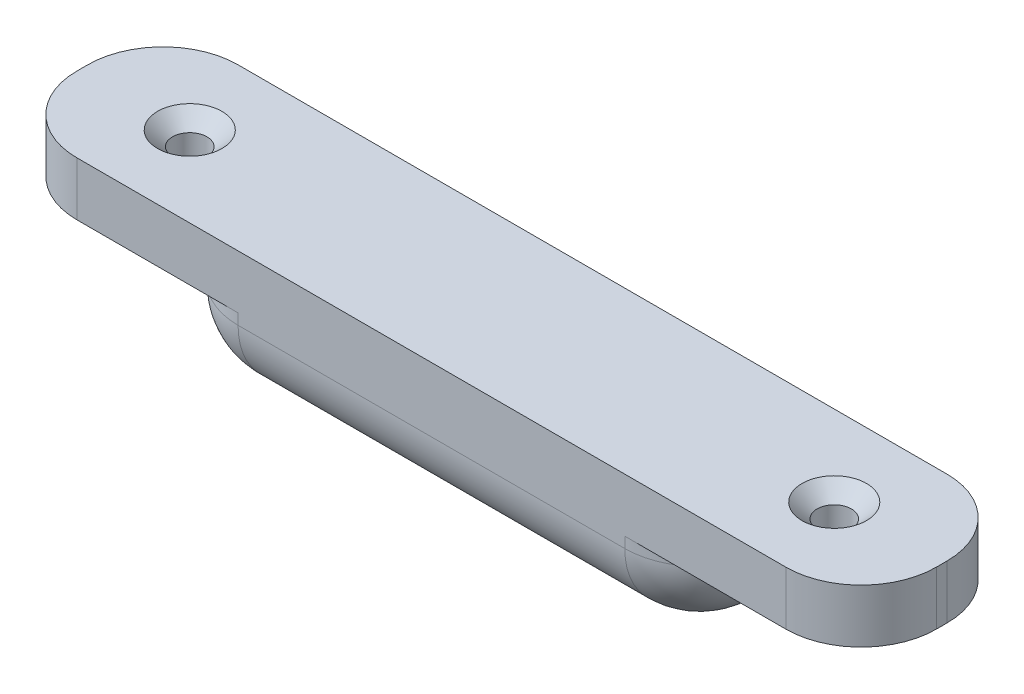
ISO-10303-21;
HEADER;
FILE_DESCRIPTION(('STEP AP214'),'2;1');
FILE_NAME('part.step','',(''),(''),'','','');
FILE_SCHEMA(('AUTOMOTIVE_DESIGN { 1 0 10303 214 1 1 1 1 }'));
ENDSEC;
DATA;
#1=APPLICATION_CONTEXT('core data for automotive mechanical design processes');
#2=APPLICATION_PROTOCOL_DEFINITION('international standard','automotive_design',2000,#1);
#3=PRODUCT_CONTEXT('',#1,'mechanical');
#4=PRODUCT('Part','Part','',(#3));
#5=PRODUCT_RELATED_PRODUCT_CATEGORY('part','',(#4));
#6=PRODUCT_DEFINITION_FORMATION('','',#4);
#7=PRODUCT_DEFINITION_CONTEXT('part definition',#1,'design');
#8=PRODUCT_DEFINITION('design','',#6,#7);
#9=PRODUCT_DEFINITION_SHAPE('','',#8);
#10=(LENGTH_UNIT() NAMED_UNIT(*) SI_UNIT(.MILLI.,.METRE.));
#11=(NAMED_UNIT(*) PLANE_ANGLE_UNIT() SI_UNIT($,.RADIAN.));
#12=(NAMED_UNIT(*) SI_UNIT($,.STERADIAN.) SOLID_ANGLE_UNIT());
#13=UNCERTAINTY_MEASURE_WITH_UNIT(LENGTH_MEASURE(1.E-05),#10,'distance_accuracy_value','');
#14=(GEOMETRIC_REPRESENTATION_CONTEXT(3) GLOBAL_UNCERTAINTY_ASSIGNED_CONTEXT((#13)) GLOBAL_UNIT_ASSIGNED_CONTEXT((#10,
#11,#12)) REPRESENTATION_CONTEXT('',''));
#15=CARTESIAN_POINT('',(0.,0.,0.));
#16=DIRECTION('',(0.,0.,1.));
#17=DIRECTION('',(1.,0.,0.));
#18=AXIS2_PLACEMENT_3D('',#15,#16,#17);
#19=CARTESIAN_POINT('',(0.,0.,15.));
#20=DIRECTION('',(0.,1.,0.));
#21=DIRECTION('',(0.,0.,1.));
#22=AXIS2_PLACEMENT_3D('',#19,#20,#21);
#23=PLANE('',#22);
#24=DIRECTION('',(0.,0.,-1.));
#25=VECTOR('',#24,1.);
#26=CARTESIAN_POINT('',(-18.,0.,15.));
#27=LINE('',#26,#25);
#28=CARTESIAN_POINT('',(-18.,0.,8.));
#29=VERTEX_POINT('',#28);
#30=CARTESIAN_POINT('',(-18.,0.,7.));
#31=VERTEX_POINT('',#30);
#32=EDGE_CURVE('E314',#29,#31,#27,.T.);
#33=ORIENTED_EDGE('',*,*,#32,.T.);
#34=DIRECTION('',(1.,0.,0.));
#35=VECTOR('',#34,1.);
#36=CARTESIAN_POINT('',(0.,0.,7.));
#37=LINE('',#36,#35);
#38=CARTESIAN_POINT('',(18.,0.,7.));
#39=VERTEX_POINT('',#38);
#40=EDGE_CURVE('E317',#31,#39,#37,.T.);
#41=ORIENTED_EDGE('',*,*,#40,.T.);
#42=DIRECTION('',(0.,0.,-1.));
#43=VECTOR('',#42,1.);
#44=CARTESIAN_POINT('',(18.,0.,15.));
#45=LINE('',#44,#43);
#46=CARTESIAN_POINT('',(18.,0.,8.));
#47=VERTEX_POINT('',#46);
#48=EDGE_CURVE('E312',#39,#47,#45,.F.);
#49=ORIENTED_EDGE('',*,*,#48,.T.);
#50=DIRECTION('',(1.,0.,0.));
#51=VECTOR('',#50,1.);
#52=CARTESIAN_POINT('',(-25.,0.,8.));
#53=LINE('',#52,#51);
#54=EDGE_CURVE('E310',#47,#29,#53,.F.);
#55=ORIENTED_EDGE('',*,*,#54,.T.);
#56=EDGE_LOOP('',(#33,#41,#49,#55));
#57=FACE_BOUND('',#56,.T.);
#58=ADVANCED_FACE('F37',(#57),#23,.F.);
#59=CARTESIAN_POINT('',(25.,0.,15.));
#60=DIRECTION('',(1.,0.,0.));
#61=DIRECTION('',(0.,0.,-1.));
#62=AXIS2_PLACEMENT_3D('',#59,#60,#61);
#63=PLANE('',#62);
#64=DIRECTION('',(0.,0.,-1.));
#65=VECTOR('',#64,1.);
#66=CARTESIAN_POINT('',(25.,8.,15.));
#67=LINE('',#66,#65);
#68=CARTESIAN_POINT('',(25.,8.,8.));
#69=VERTEX_POINT('',#68);
#70=CARTESIAN_POINT('',(25.,8.,7.));
#71=VERTEX_POINT('',#70);
#72=EDGE_CURVE('E272',#69,#71,#67,.T.);
#73=ORIENTED_EDGE('',*,*,#72,.F.);
#74=DIRECTION('',(0.,-1.,0.));
#75=VECTOR('',#74,1.);
#76=CARTESIAN_POINT('',(25.,0.,8.));
#77=LINE('',#76,#75);
#78=CARTESIAN_POINT('',(25.,7.,8.));
#79=VERTEX_POINT('',#78);
#80=EDGE_CURVE('E308',#69,#79,#77,.T.);
#81=ORIENTED_EDGE('',*,*,#80,.T.);
#82=DIRECTION('',(0.,0.,-1.));
#83=VECTOR('',#82,1.);
#84=CARTESIAN_POINT('',(25.,7.,0.));
#85=LINE('',#84,#83);
#86=CARTESIAN_POINT('',(25.,7.,7.));
#87=VERTEX_POINT('',#86);
#88=EDGE_CURVE('E304',#79,#87,#85,.T.);
#89=ORIENTED_EDGE('',*,*,#88,.T.);
#90=DIRECTION('',(0.,-1.,0.));
#91=VECTOR('',#90,1.);
#92=CARTESIAN_POINT('',(25.,8.,7.));
#93=LINE('',#92,#91);
#94=EDGE_CURVE('E306',#87,#71,#93,.F.);
#95=ORIENTED_EDGE('',*,*,#94,.T.);
#96=EDGE_LOOP('',(#73,#81,#89,#95));
#97=FACE_BOUND('',#96,.T.);
#98=ADVANCED_FACE('F410',(#97),#63,.T.);
#99=CARTESIAN_POINT('',(0.,8.,15.));
#100=DIRECTION('',(0.,-1.,0.));
#101=DIRECTION('',(0.,0.,-1.));
#102=AXIS2_PLACEMENT_3D('',#99,#100,#101);
#103=PLANE('',#102);
#104=CARTESIAN_POINT('',(30.,8.,7.5));
#105=DIRECTION('',(0.,-1.,0.));
#106=DIRECTION('',(0.,0.,-1.));
#107=AXIS2_PLACEMENT_3D('',#104,#105,#106);
#108=CIRCLE('',#107,1.6);
#109=CARTESIAN_POINT('',(30.,8.,5.9));
#110=VERTEX_POINT('',#109);
#111=EDGE_CURVE('E248',#110,#110,#108,.T.);
#112=ORIENTED_EDGE('',*,*,#111,.F.);
#113=EDGE_LOOP('',(#112));
#114=FACE_BOUND('',#113,.T.);
#115=DIRECTION('',(0.,0.,-1.));
#116=VECTOR('',#115,1.);
#117=CARTESIAN_POINT('',(40.,8.,15.));
#118=LINE('',#117,#116);
#119=CARTESIAN_POINT('',(40.,8.,8.));
#120=VERTEX_POINT('',#119);
#121=CARTESIAN_POINT('',(40.,8.,7.));
#122=VERTEX_POINT('',#121);
#123=EDGE_CURVE('E269',#120,#122,#118,.T.);
#124=ORIENTED_EDGE('',*,*,#123,.F.);
#125=CARTESIAN_POINT('',(33.,8.,8.));
#126=DIRECTION('',(0.,-1.,0.));
#127=DIRECTION('',(0.,0.,-1.));
#128=AXIS2_PLACEMENT_3D('',#125,#126,#127);
#129=CIRCLE('',#128,7.);
#130=CARTESIAN_POINT('',(33.,8.,15.));
#131=VERTEX_POINT('',#130);
#132=EDGE_CURVE('E326',#120,#131,#129,.T.);
#133=ORIENTED_EDGE('',*,*,#132,.T.);
#134=DIRECTION('',(-1.,0.,0.));
#135=VECTOR('',#134,1.);
#136=CARTESIAN_POINT('',(0.,8.,15.));
#137=LINE('',#136,#135);
#138=CARTESIAN_POINT('',(18.,8.,15.));
#139=VERTEX_POINT('',#138);
#140=EDGE_CURVE('E249',#131,#139,#137,.T.);
#141=ORIENTED_EDGE('',*,*,#140,.T.);
#142=CARTESIAN_POINT('',(18.,8.,8.));
#143=DIRECTION('',(0.,-1.,0.));
#144=DIRECTION('',(0.,0.,-1.));
#145=AXIS2_PLACEMENT_3D('',#142,#143,#144);
#146=CIRCLE('',#145,7.);
#147=EDGE_CURVE('E46',#139,#69,#146,.F.);
#148=ORIENTED_EDGE('',*,*,#147,.T.);
#149=ORIENTED_EDGE('',*,*,#72,.T.);
#150=CARTESIAN_POINT('',(18.,8.,7.));
#151=DIRECTION('',(0.,-1.,0.));
#152=DIRECTION('',(0.,0.,-1.));
#153=AXIS2_PLACEMENT_3D('',#150,#151,#152);
#154=CIRCLE('',#153,7.);
#155=CARTESIAN_POINT('',(18.,8.,0.));
#156=VERTEX_POINT('',#155);
#157=EDGE_CURVE('E11',#71,#156,#154,.F.);
#158=ORIENTED_EDGE('',*,*,#157,.T.);
#159=DIRECTION('',(-1.,0.,0.));
#160=VECTOR('',#159,1.);
#161=CARTESIAN_POINT('',(0.,8.,0.));
#162=LINE('',#161,#160);
#163=CARTESIAN_POINT('',(33.,8.,0.));
#164=VERTEX_POINT('',#163);
#165=EDGE_CURVE('E256',#164,#156,#162,.T.);
#166=ORIENTED_EDGE('',*,*,#165,.F.);
#167=CARTESIAN_POINT('',(33.,8.,7.));
#168=DIRECTION('',(0.,-1.,0.));
#169=DIRECTION('',(0.,0.,-1.));
#170=AXIS2_PLACEMENT_3D('',#167,#168,#169);
#171=CIRCLE('',#170,7.);
#172=EDGE_CURVE('E324',#164,#122,#171,.T.);
#173=ORIENTED_EDGE('',*,*,#172,.T.);
#174=EDGE_LOOP('',(#124,#133,#141,#148,#149,#158,#166,#173));
#175=FACE_BOUND('',#174,.T.);
#176=ADVANCED_FACE('F376',(#114,#175),#103,.T.);
#177=CARTESIAN_POINT('',(40.,0.,15.));
#178=DIRECTION('',(1.,0.,0.));
#179=DIRECTION('',(0.,0.,-1.));
#180=AXIS2_PLACEMENT_3D('',#177,#178,#179);
#181=PLANE('',#180);
#182=DIRECTION('',(0.,0.,-1.));
#183=VECTOR('',#182,1.);
#184=CARTESIAN_POINT('',(40.,13.,15.));
#185=LINE('',#184,#183);
#186=CARTESIAN_POINT('',(40.,13.,8.));
#187=VERTEX_POINT('',#186);
#188=CARTESIAN_POINT('',(40.,13.,7.));
#189=VERTEX_POINT('',#188);
#190=EDGE_CURVE('E266',#187,#189,#185,.T.);
#191=ORIENTED_EDGE('',*,*,#190,.F.);
#192=DIRECTION('',(0.,-1.,0.));
#193=VECTOR('',#192,1.);
#194=CARTESIAN_POINT('',(40.,0.,8.));
#195=LINE('',#194,#193);
#196=EDGE_CURVE('E321',#187,#120,#195,.T.);
#197=ORIENTED_EDGE('',*,*,#196,.T.);
#198=ORIENTED_EDGE('',*,*,#123,.T.);
#199=DIRECTION('',(0.,-1.,0.));
#200=VECTOR('',#199,1.);
#201=CARTESIAN_POINT('',(40.,13.,7.));
#202=LINE('',#201,#200);
#203=EDGE_CURVE('E319',#122,#189,#202,.F.);
#204=ORIENTED_EDGE('',*,*,#203,.T.);
#205=EDGE_LOOP('',(#191,#197,#198,#204));
#206=FACE_BOUND('',#205,.T.);
#207=ADVANCED_FACE('F368',(#206),#181,.T.);
#208=CARTESIAN_POINT('',(0.,13.,15.));
#209=DIRECTION('',(0.,-1.,0.));
#210=DIRECTION('',(0.,0.,-1.));
#211=AXIS2_PLACEMENT_3D('',#208,#209,#210);
#212=PLANE('',#211);
#213=CARTESIAN_POINT('',(-30.,13.,7.5));
#214=DIRECTION('',(0.,1.,0.));
#215=DIRECTION('',(0.,0.,1.));
#216=AXIS2_PLACEMENT_3D('',#213,#214,#215);
#217=CIRCLE('',#216,3.);
#218=CARTESIAN_POINT('',(-30.,13.,10.5));
#219=VERTEX_POINT('',#218);
#220=EDGE_CURVE('E229',#219,#219,#217,.T.);
#221=ORIENTED_EDGE('',*,*,#220,.F.);
#222=EDGE_LOOP('',(#221));
#223=FACE_BOUND('',#222,.T.);
#224=CARTESIAN_POINT('',(30.,13.,7.5));
#225=DIRECTION('',(0.,1.,0.));
#226=DIRECTION('',(0.,0.,1.));
#227=AXIS2_PLACEMENT_3D('',#224,#225,#226);
#228=CIRCLE('',#227,3.);
#229=CARTESIAN_POINT('',(30.,13.,10.5));
#230=VERTEX_POINT('',#229);
#231=EDGE_CURVE('E242',#230,#230,#228,.T.);
#232=ORIENTED_EDGE('',*,*,#231,.F.);
#233=EDGE_LOOP('',(#232));
#234=FACE_BOUND('',#233,.T.);
#235=DIRECTION('',(-1.,0.,0.));
#236=VECTOR('',#235,1.);
#237=CARTESIAN_POINT('',(0.,13.,15.));
#238=LINE('',#237,#236);
#239=CARTESIAN_POINT('',(33.,13.,15.));
#240=VERTEX_POINT('',#239);
#241=CARTESIAN_POINT('',(-33.,13.,15.));
#242=VERTEX_POINT('',#241);
#243=EDGE_CURVE('E251',#240,#242,#238,.T.);
#244=ORIENTED_EDGE('',*,*,#243,.F.);
#245=CARTESIAN_POINT('',(33.,13.,8.));
#246=DIRECTION('',(0.,-1.,0.));
#247=DIRECTION('',(0.,0.,-1.));
#248=AXIS2_PLACEMENT_3D('',#245,#246,#247);
#249=CIRCLE('',#248,7.);
#250=EDGE_CURVE('E334',#240,#187,#249,.F.);
#251=ORIENTED_EDGE('',*,*,#250,.T.);
#252=ORIENTED_EDGE('',*,*,#190,.T.);
#253=CARTESIAN_POINT('',(33.,13.,7.));
#254=DIRECTION('',(0.,-1.,0.));
#255=DIRECTION('',(0.,0.,-1.));
#256=AXIS2_PLACEMENT_3D('',#253,#254,#255);
#257=CIRCLE('',#256,7.);
#258=CARTESIAN_POINT('',(33.,13.,0.));
#259=VERTEX_POINT('',#258);
#260=EDGE_CURVE('E332',#189,#259,#257,.F.);
#261=ORIENTED_EDGE('',*,*,#260,.T.);
#262=DIRECTION('',(-1.,0.,0.));
#263=VECTOR('',#262,1.);
#264=CARTESIAN_POINT('',(0.,13.,0.));
#265=LINE('',#264,#263);
#266=CARTESIAN_POINT('',(-33.,13.,0.));
#267=VERTEX_POINT('',#266);
#268=EDGE_CURVE('E258',#259,#267,#265,.T.);
#269=ORIENTED_EDGE('',*,*,#268,.T.);
#270=CARTESIAN_POINT('',(-33.,13.,7.));
#271=DIRECTION('',(0.,-1.,0.));
#272=DIRECTION('',(0.,0.,-1.));
#273=AXIS2_PLACEMENT_3D('',#270,#271,#272);
#274=CIRCLE('',#273,7.);
#275=CARTESIAN_POINT('',(-40.,13.,7.));
#276=VERTEX_POINT('',#275);
#277=EDGE_CURVE('E330',#267,#276,#274,.F.);
#278=ORIENTED_EDGE('',*,*,#277,.T.);
#279=DIRECTION('',(0.,0.,-1.));
#280=VECTOR('',#279,1.);
#281=CARTESIAN_POINT('',(-40.,13.,15.));
#282=LINE('',#281,#280);
#283=CARTESIAN_POINT('',(-40.,13.,8.));
#284=VERTEX_POINT('',#283);
#285=EDGE_CURVE('E263',#284,#276,#282,.T.);
#286=ORIENTED_EDGE('',*,*,#285,.F.);
#287=CARTESIAN_POINT('',(-33.,13.,8.));
#288=DIRECTION('',(0.,-1.,0.));
#289=DIRECTION('',(0.,0.,-1.));
#290=AXIS2_PLACEMENT_3D('',#287,#288,#289);
#291=CIRCLE('',#290,7.);
#292=EDGE_CURVE('E328',#284,#242,#291,.F.);
#293=ORIENTED_EDGE('',*,*,#292,.T.);
#294=EDGE_LOOP('',(#244,#251,#252,#261,#269,#278,#286,#293));
#295=FACE_BOUND('',#294,.T.);
#296=ADVANCED_FACE('F350',(#223,#234,#295),#212,.F.);
#297=CARTESIAN_POINT('',(-40.,0.,15.));
#298=DIRECTION('',(1.,0.,0.));
#299=DIRECTION('',(0.,0.,-1.));
#300=AXIS2_PLACEMENT_3D('',#297,#298,#299);
#301=PLANE('',#300);
#302=ORIENTED_EDGE('',*,*,#285,.T.);
#303=DIRECTION('',(0.,-1.,0.));
#304=VECTOR('',#303,1.);
#305=CARTESIAN_POINT('',(-40.,0.,7.));
#306=LINE('',#305,#304);
#307=CARTESIAN_POINT('',(-40.,8.,7.));
#308=VERTEX_POINT('',#307);
#309=EDGE_CURVE('E338',#276,#308,#306,.T.);
#310=ORIENTED_EDGE('',*,*,#309,.T.);
#311=DIRECTION('',(0.,0.,-1.));
#312=VECTOR('',#311,1.);
#313=CARTESIAN_POINT('',(-40.,8.,15.));
#314=LINE('',#313,#312);
#315=CARTESIAN_POINT('',(-40.,8.,8.));
#316=VERTEX_POINT('',#315);
#317=EDGE_CURVE('E186',#316,#308,#314,.T.);
#318=ORIENTED_EDGE('',*,*,#317,.F.);
#319=DIRECTION('',(0.,-1.,0.));
#320=VECTOR('',#319,1.);
#321=CARTESIAN_POINT('',(-40.,13.,8.));
#322=LINE('',#321,#320);
#323=EDGE_CURVE('E336',#316,#284,#322,.F.);
#324=ORIENTED_EDGE('',*,*,#323,.T.);
#325=EDGE_LOOP('',(#302,#310,#318,#324));
#326=FACE_BOUND('',#325,.T.);
#327=ADVANCED_FACE('F353',(#326),#301,.F.);
#328=CARTESIAN_POINT('',(0.,8.,15.));
#329=DIRECTION('',(0.,1.,0.));
#330=DIRECTION('',(0.,0.,1.));
#331=AXIS2_PLACEMENT_3D('',#328,#329,#330);
#332=PLANE('',#331);
#333=CARTESIAN_POINT('',(-30.,8.,7.5));
#334=DIRECTION('',(0.,1.,0.));
#335=DIRECTION('',(0.,0.,1.));
#336=AXIS2_PLACEMENT_3D('',#333,#334,#335);
#337=CIRCLE('',#336,1.6);
#338=CARTESIAN_POINT('',(-30.,8.,9.1));
#339=VERTEX_POINT('',#338);
#340=EDGE_CURVE('E239',#339,#339,#337,.T.);
#341=ORIENTED_EDGE('',*,*,#340,.T.);
#342=EDGE_LOOP('',(#341));
#343=FACE_BOUND('',#342,.T.);
#344=ORIENTED_EDGE('',*,*,#317,.T.);
#345=CARTESIAN_POINT('',(-33.,8.,7.));
#346=DIRECTION('',(0.,1.,0.));
#347=DIRECTION('',(0.,0.,1.));
#348=AXIS2_PLACEMENT_3D('',#345,#346,#347);
#349=CIRCLE('',#348,7.);
#350=CARTESIAN_POINT('',(-33.,8.,0.));
#351=VERTEX_POINT('',#350);
#352=EDGE_CURVE('E54',#308,#351,#349,.F.);
#353=ORIENTED_EDGE('',*,*,#352,.T.);
#354=DIRECTION('',(1.,0.,0.));
#355=VECTOR('',#354,1.);
#356=CARTESIAN_POINT('',(0.,8.,0.));
#357=LINE('',#356,#355);
#358=CARTESIAN_POINT('',(-18.,8.,0.));
#359=VERTEX_POINT('',#358);
#360=EDGE_CURVE('E252',#351,#359,#357,.T.);
#361=ORIENTED_EDGE('',*,*,#360,.T.);
#362=CARTESIAN_POINT('',(-18.,8.,7.));
#363=DIRECTION('',(0.,1.,0.));
#364=DIRECTION('',(0.,0.,1.));
#365=AXIS2_PLACEMENT_3D('',#362,#363,#364);
#366=CIRCLE('',#365,7.);
#367=CARTESIAN_POINT('',(-25.,8.,7.));
#368=VERTEX_POINT('',#367);
#369=EDGE_CURVE('E185',#359,#368,#366,.T.);
#370=ORIENTED_EDGE('',*,*,#369,.T.);
#371=DIRECTION('',(0.,0.,-1.));
#372=VECTOR('',#371,1.);
#373=CARTESIAN_POINT('',(-25.,8.,15.));
#374=LINE('',#373,#372);
#375=CARTESIAN_POINT('',(-25.,8.,8.));
#376=VERTEX_POINT('',#375);
#377=EDGE_CURVE('E170',#376,#368,#374,.T.);
#378=ORIENTED_EDGE('',*,*,#377,.F.);
#379=CARTESIAN_POINT('',(-18.,8.,8.));
#380=DIRECTION('',(0.,1.,0.));
#381=DIRECTION('',(0.,0.,1.));
#382=AXIS2_PLACEMENT_3D('',#379,#380,#381);
#383=CIRCLE('',#382,7.);
#384=CARTESIAN_POINT('',(-18.,8.,15.));
#385=VERTEX_POINT('',#384);
#386=EDGE_CURVE('E182',#376,#385,#383,.T.);
#387=ORIENTED_EDGE('',*,*,#386,.T.);
#388=DIRECTION('',(1.,0.,0.));
#389=VECTOR('',#388,1.);
#390=CARTESIAN_POINT('',(0.,8.,15.));
#391=LINE('',#390,#389);
#392=CARTESIAN_POINT('',(-33.,8.,15.));
#393=VERTEX_POINT('',#392);
#394=EDGE_CURVE('E187',#393,#385,#391,.T.);
#395=ORIENTED_EDGE('',*,*,#394,.F.);
#396=CARTESIAN_POINT('',(-33.,8.,8.));
#397=DIRECTION('',(0.,1.,0.));
#398=DIRECTION('',(0.,0.,1.));
#399=AXIS2_PLACEMENT_3D('',#396,#397,#398);
#400=CIRCLE('',#399,7.);
#401=EDGE_CURVE('E62',#393,#316,#400,.F.);
#402=ORIENTED_EDGE('',*,*,#401,.T.);
#403=EDGE_LOOP('',(#344,#353,#361,#370,#378,#387,#395,#402));
#404=FACE_BOUND('',#403,.T.);
#405=ADVANCED_FACE('F181',(#343,#404),#332,.F.);
#406=CARTESIAN_POINT('',(-25.,0.,15.));
#407=DIRECTION('',(1.,0.,0.));
#408=DIRECTION('',(0.,0.,-1.));
#409=AXIS2_PLACEMENT_3D('',#406,#407,#408);
#410=PLANE('',#409);
#411=ORIENTED_EDGE('',*,*,#377,.T.);
#412=DIRECTION('',(0.,-1.,0.));
#413=VECTOR('',#412,1.);
#414=CARTESIAN_POINT('',(-25.,0.,7.));
#415=LINE('',#414,#413);
#416=CARTESIAN_POINT('',(-25.,7.,7.));
#417=VERTEX_POINT('',#416);
#418=EDGE_CURVE('E178',#368,#417,#415,.T.);
#419=ORIENTED_EDGE('',*,*,#418,.T.);
#420=DIRECTION('',(0.,0.,-1.));
#421=VECTOR('',#420,1.);
#422=CARTESIAN_POINT('',(-25.,7.,15.));
#423=LINE('',#422,#421);
#424=CARTESIAN_POINT('',(-25.,7.,8.));
#425=VERTEX_POINT('',#424);
#426=EDGE_CURVE('E173',#417,#425,#423,.F.);
#427=ORIENTED_EDGE('',*,*,#426,.T.);
#428=DIRECTION('',(0.,-1.,0.));
#429=VECTOR('',#428,1.);
#430=CARTESIAN_POINT('',(-25.,8.,8.));
#431=LINE('',#430,#429);
#432=EDGE_CURVE('E166',#425,#376,#431,.F.);
#433=ORIENTED_EDGE('',*,*,#432,.T.);
#434=EDGE_LOOP('',(#411,#419,#427,#433));
#435=FACE_BOUND('',#434,.T.);
#436=ADVANCED_FACE('F168',(#435),#410,.F.);
#437=CARTESIAN_POINT('',(0.,0.,15.));
#438=DIRECTION('',(0.,0.,1.));
#439=DIRECTION('',(1.,0.,0.));
#440=AXIS2_PLACEMENT_3D('',#437,#438,#439);
#441=PLANE('',#440);
#442=ORIENTED_EDGE('',*,*,#140,.F.);
#443=DIRECTION('',(0.,-1.,0.));
#444=VECTOR('',#443,1.);
#445=CARTESIAN_POINT('',(33.,0.,15.));
#446=LINE('',#445,#444);
#447=EDGE_CURVE('E302',#131,#240,#446,.F.);
#448=ORIENTED_EDGE('',*,*,#447,.T.);
#449=ORIENTED_EDGE('',*,*,#243,.T.);
#450=DIRECTION('',(0.,-1.,0.));
#451=VECTOR('',#450,1.);
#452=CARTESIAN_POINT('',(-33.,8.,15.));
#453=LINE('',#452,#451);
#454=EDGE_CURVE('E293',#242,#393,#453,.T.);
#455=ORIENTED_EDGE('',*,*,#454,.T.);
#456=ORIENTED_EDGE('',*,*,#394,.T.);
#457=DIRECTION('',(0.,-1.,0.));
#458=VECTOR('',#457,1.);
#459=CARTESIAN_POINT('',(-18.,0.,15.));
#460=LINE('',#459,#458);
#461=CARTESIAN_POINT('',(-18.,7.,15.));
#462=VERTEX_POINT('',#461);
#463=EDGE_CURVE('E190',#385,#462,#460,.T.);
#464=ORIENTED_EDGE('',*,*,#463,.T.);
#465=DIRECTION('',(1.,0.,0.));
#466=VECTOR('',#465,1.);
#467=CARTESIAN_POINT('',(25.,7.,15.));
#468=LINE('',#467,#466);
#469=CARTESIAN_POINT('',(18.,7.,15.));
#470=VERTEX_POINT('',#469);
#471=EDGE_CURVE('E296',#462,#470,#468,.T.);
#472=ORIENTED_EDGE('',*,*,#471,.T.);
#473=DIRECTION('',(0.,-1.,0.));
#474=VECTOR('',#473,1.);
#475=CARTESIAN_POINT('',(18.,0.,15.));
#476=LINE('',#475,#474);
#477=EDGE_CURVE('E298',#470,#139,#476,.F.);
#478=ORIENTED_EDGE('',*,*,#477,.T.);
#479=EDGE_LOOP('',(#442,#448,#449,#455,#456,#464,#472,#478));
#480=FACE_BOUND('',#479,.T.);
#481=ADVANCED_FACE('F360',(#480),#441,.T.);
#482=CARTESIAN_POINT('',(0.,0.,0.));
#483=DIRECTION('',(0.,0.,1.));
#484=DIRECTION('',(1.,0.,0.));
#485=AXIS2_PLACEMENT_3D('',#482,#483,#484);
#486=PLANE('',#485);
#487=ORIENTED_EDGE('',*,*,#268,.F.);
#488=DIRECTION('',(0.,-1.,0.));
#489=VECTOR('',#488,1.);
#490=CARTESIAN_POINT('',(33.,8.,0.));
#491=LINE('',#490,#489);
#492=EDGE_CURVE('E290',#259,#164,#491,.T.);
#493=ORIENTED_EDGE('',*,*,#492,.T.);
#494=ORIENTED_EDGE('',*,*,#165,.T.);
#495=DIRECTION('',(0.,-1.,0.));
#496=VECTOR('',#495,1.);
#497=CARTESIAN_POINT('',(18.,0.,0.));
#498=LINE('',#497,#496);
#499=CARTESIAN_POINT('',(18.,7.,0.));
#500=VERTEX_POINT('',#499);
#501=EDGE_CURVE('E285',#156,#500,#498,.T.);
#502=ORIENTED_EDGE('',*,*,#501,.T.);
#503=DIRECTION('',(1.,0.,0.));
#504=VECTOR('',#503,1.);
#505=CARTESIAN_POINT('',(0.,7.,0.));
#506=LINE('',#505,#504);
#507=CARTESIAN_POINT('',(-18.,7.,0.));
#508=VERTEX_POINT('',#507);
#509=EDGE_CURVE('E283',#500,#508,#506,.F.);
#510=ORIENTED_EDGE('',*,*,#509,.T.);
#511=DIRECTION('',(0.,-1.,0.));
#512=VECTOR('',#511,1.);
#513=CARTESIAN_POINT('',(-18.,0.,0.));
#514=LINE('',#513,#512);
#515=EDGE_CURVE('E287',#508,#359,#514,.F.);
#516=ORIENTED_EDGE('',*,*,#515,.T.);
#517=ORIENTED_EDGE('',*,*,#360,.F.);
#518=DIRECTION('',(0.,-1.,0.));
#519=VECTOR('',#518,1.);
#520=CARTESIAN_POINT('',(-33.,0.,0.));
#521=LINE('',#520,#519);
#522=EDGE_CURVE('E281',#351,#267,#521,.F.);
#523=ORIENTED_EDGE('',*,*,#522,.T.);
#524=EDGE_LOOP('',(#487,#493,#494,#502,#510,#516,#517,#523));
#525=FACE_BOUND('',#524,.T.);
#526=ADVANCED_FACE('F343',(#525),#486,.F.);
#527=CARTESIAN_POINT('',(30.,13.,7.5));
#528=DIRECTION('',(0.,1.,0.));
#529=DIRECTION('',(0.,0.,1.));
#530=AXIS2_PLACEMENT_3D('',#527,#528,#529);
#531=CYLINDRICAL_SURFACE('',#530,1.6);
#532=ORIENTED_EDGE('',*,*,#111,.T.);
#533=EDGE_LOOP('',(#532));
#534=FACE_BOUND('',#533,.T.);
#535=CARTESIAN_POINT('',(30.,11.6480357152701,7.5));
#536=DIRECTION('',(0.,1.,0.));
#537=DIRECTION('',(0.,0.,1.));
#538=AXIS2_PLACEMENT_3D('',#535,#536,#537);
#539=CIRCLE('',#538,1.6);
#540=CARTESIAN_POINT('',(30.,11.6480357152701,9.1));
#541=VERTEX_POINT('',#540);
#542=EDGE_CURVE('E245',#541,#541,#539,.T.);
#543=ORIENTED_EDGE('',*,*,#542,.T.);
#544=EDGE_LOOP('',(#543));
#545=FACE_BOUND('',#544,.T.);
#546=ADVANCED_FACE('F572',(#534,#545),#531,.F.);
#547=CARTESIAN_POINT('',(30.,13.,7.5));
#548=DIRECTION('',(0.,1.,0.));
#549=DIRECTION('',(0.,0.,1.));
#550=AXIS2_PLACEMENT_3D('',#547,#548,#549);
#551=CONICAL_SURFACE('',#550,3.,0.802851455917394);
#552=ORIENTED_EDGE('',*,*,#542,.F.);
#553=EDGE_LOOP('',(#552));
#554=FACE_BOUND('',#553,.T.);
#555=ORIENTED_EDGE('',*,*,#231,.T.);
#556=EDGE_LOOP('',(#555));
#557=FACE_BOUND('',#556,.T.);
#558=ADVANCED_FACE('F563',(#554,#557),#551,.F.);
#559=CARTESIAN_POINT('',(-30.,13.,7.5));
#560=DIRECTION('',(0.,1.,0.));
#561=DIRECTION('',(0.,0.,1.));
#562=AXIS2_PLACEMENT_3D('',#559,#560,#561);
#563=CYLINDRICAL_SURFACE('',#562,1.6);
#564=CARTESIAN_POINT('',(-30.,11.6480357152701,7.5));
#565=DIRECTION('',(0.,1.,0.));
#566=DIRECTION('',(0.,0.,1.));
#567=AXIS2_PLACEMENT_3D('',#564,#565,#566);
#568=CIRCLE('',#567,1.6);
#569=CARTESIAN_POINT('',(-30.,11.6480357152701,9.1));
#570=VERTEX_POINT('',#569);
#571=EDGE_CURVE('E234',#570,#570,#568,.T.);
#572=ORIENTED_EDGE('',*,*,#571,.T.);
#573=EDGE_LOOP('',(#572));
#574=FACE_BOUND('',#573,.T.);
#575=ORIENTED_EDGE('',*,*,#340,.F.);
#576=EDGE_LOOP('',(#575));
#577=FACE_BOUND('',#576,.T.);
#578=ADVANCED_FACE('F554',(#574,#577),#563,.F.);
#579=CARTESIAN_POINT('',(-30.,13.,7.5));
#580=DIRECTION('',(0.,1.,0.));
#581=DIRECTION('',(0.,0.,1.));
#582=AXIS2_PLACEMENT_3D('',#579,#580,#581);
#583=CONICAL_SURFACE('',#582,3.,0.802851455917392);
#584=ORIENTED_EDGE('',*,*,#571,.F.);
#585=EDGE_LOOP('',(#584));
#586=FACE_BOUND('',#585,.T.);
#587=ORIENTED_EDGE('',*,*,#220,.T.);
#588=EDGE_LOOP('',(#587));
#589=FACE_BOUND('',#588,.T.);
#590=ADVANCED_FACE('F545',(#586,#589),#583,.F.);
#591=CARTESIAN_POINT('',(18.,0.,8.));
#592=DIRECTION('',(0.,-1.,0.));
#593=DIRECTION('',(0.,0.,-1.));
#594=AXIS2_PLACEMENT_3D('',#591,#592,#593);
#595=CYLINDRICAL_SURFACE('',#594,7.);
#596=CARTESIAN_POINT('',(18.,7.,8.));
#597=DIRECTION('',(0.,-1.,0.));
#598=DIRECTION('',(0.,0.,-1.));
#599=AXIS2_PLACEMENT_3D('',#596,#597,#598);
#600=CIRCLE('',#599,7.);
#601=EDGE_CURVE('E41',#79,#470,#600,.T.);
#602=ORIENTED_EDGE('',*,*,#601,.F.);
#603=ORIENTED_EDGE('',*,*,#80,.F.);
#604=ORIENTED_EDGE('',*,*,#147,.F.);
#605=ORIENTED_EDGE('',*,*,#477,.F.);
#606=EDGE_LOOP('',(#602,#603,#604,#605));
#607=FACE_BOUND('',#606,.T.);
#608=ADVANCED_FACE('F407',(#607),#595,.T.);
#609=CARTESIAN_POINT('',(18.,7.,8.));
#610=DIRECTION('',(0.,0.,1.));
#611=DIRECTION('',(1.,0.,0.));
#612=AXIS2_PLACEMENT_3D('',#609,#610,#611);
#613=SPHERICAL_SURFACE('',#612,7.);
#614=CARTESIAN_POINT('',(18.,7.,8.));
#615=DIRECTION('',(0.,0.,1.));
#616=DIRECTION('',(1.,0.,0.));
#617=AXIS2_PLACEMENT_3D('',#614,#615,#616);
#618=CIRCLE('',#617,7.);
#619=EDGE_CURVE('E220',#79,#47,#618,.F.);
#620=ORIENTED_EDGE('',*,*,#619,.F.);
#621=ORIENTED_EDGE('',*,*,#601,.T.);
#622=CARTESIAN_POINT('',(18.,7.,8.));
#623=DIRECTION('',(1.,0.,0.));
#624=DIRECTION('',(0.,0.,-1.));
#625=AXIS2_PLACEMENT_3D('',#622,#623,#624);
#626=CIRCLE('',#625,7.);
#627=EDGE_CURVE('E222',#47,#470,#626,.F.);
#628=ORIENTED_EDGE('',*,*,#627,.F.);
#629=EDGE_LOOP('',(#620,#621,#628));
#630=FACE_BOUND('',#629,.T.);
#631=ADVANCED_FACE('F530',(#630),#613,.T.);
#632=CARTESIAN_POINT('',(-18.,0.,8.));
#633=DIRECTION('',(0.,1.,0.));
#634=DIRECTION('',(0.,0.,1.));
#635=AXIS2_PLACEMENT_3D('',#632,#633,#634);
#636=CYLINDRICAL_SURFACE('',#635,7.);
#637=ORIENTED_EDGE('',*,*,#386,.F.);
#638=ORIENTED_EDGE('',*,*,#432,.F.);
#639=CARTESIAN_POINT('',(-18.,7.,8.));
#640=DIRECTION('',(0.,-1.,0.));
#641=DIRECTION('',(0.,0.,-1.));
#642=AXIS2_PLACEMENT_3D('',#639,#640,#641);
#643=CIRCLE('',#642,7.);
#644=EDGE_CURVE('E218',#462,#425,#643,.T.);
#645=ORIENTED_EDGE('',*,*,#644,.F.);
#646=ORIENTED_EDGE('',*,*,#463,.F.);
#647=EDGE_LOOP('',(#637,#638,#645,#646));
#648=FACE_BOUND('',#647,.T.);
#649=ADVANCED_FACE('F189',(#648),#636,.T.);
#650=CARTESIAN_POINT('',(0.,7.,8.));
#651=DIRECTION('',(-1.,0.,0.));
#652=DIRECTION('',(0.,0.,1.));
#653=AXIS2_PLACEMENT_3D('',#650,#651,#652);
#654=CYLINDRICAL_SURFACE('',#653,7.);
#655=ORIENTED_EDGE('',*,*,#627,.T.);
#656=ORIENTED_EDGE('',*,*,#471,.F.);
#657=CARTESIAN_POINT('',(-18.,7.,8.));
#658=DIRECTION('',(-1.,0.,0.));
#659=DIRECTION('',(0.,0.,1.));
#660=AXIS2_PLACEMENT_3D('',#657,#658,#659);
#661=CIRCLE('',#660,7.);
#662=EDGE_CURVE('E215',#29,#462,#661,.T.);
#663=ORIENTED_EDGE('',*,*,#662,.F.);
#664=ORIENTED_EDGE('',*,*,#54,.F.);
#665=EDGE_LOOP('',(#655,#656,#663,#664));
#666=FACE_BOUND('',#665,.T.);
#667=ADVANCED_FACE('F403',(#666),#654,.T.);
#668=CARTESIAN_POINT('',(18.,7.,15.));
#669=DIRECTION('',(0.,0.,1.));
#670=DIRECTION('',(1.,0.,0.));
#671=AXIS2_PLACEMENT_3D('',#668,#669,#670);
#672=CYLINDRICAL_SURFACE('',#671,7.);
#673=ORIENTED_EDGE('',*,*,#619,.T.);
#674=ORIENTED_EDGE('',*,*,#48,.F.);
#675=CARTESIAN_POINT('',(18.,7.,7.));
#676=DIRECTION('',(0.,0.,-1.));
#677=DIRECTION('',(0.,1.,0.));
#678=AXIS2_PLACEMENT_3D('',#675,#676,#677);
#679=CIRCLE('',#678,7.);
#680=EDGE_CURVE('E212',#87,#39,#679,.T.);
#681=ORIENTED_EDGE('',*,*,#680,.F.);
#682=ORIENTED_EDGE('',*,*,#88,.F.);
#683=EDGE_LOOP('',(#673,#674,#681,#682));
#684=FACE_BOUND('',#683,.T.);
#685=ADVANCED_FACE('F415',(#684),#672,.T.);
#686=CARTESIAN_POINT('',(18.,0.,7.));
#687=DIRECTION('',(0.,1.,0.));
#688=DIRECTION('',(0.,0.,1.));
#689=AXIS2_PLACEMENT_3D('',#686,#687,#688);
#690=CYLINDRICAL_SURFACE('',#689,7.);
#691=ORIENTED_EDGE('',*,*,#157,.F.);
#692=ORIENTED_EDGE('',*,*,#94,.F.);
#693=CARTESIAN_POINT('',(18.,7.,7.));
#694=DIRECTION('',(0.,-1.,0.));
#695=DIRECTION('',(0.,0.,-1.));
#696=AXIS2_PLACEMENT_3D('',#693,#694,#695);
#697=CIRCLE('',#696,7.);
#698=EDGE_CURVE('E209',#500,#87,#697,.T.);
#699=ORIENTED_EDGE('',*,*,#698,.F.);
#700=ORIENTED_EDGE('',*,*,#501,.F.);
#701=EDGE_LOOP('',(#691,#692,#699,#700));
#702=FACE_BOUND('',#701,.T.);
#703=ADVANCED_FACE('F383',(#702),#690,.T.);
#704=CARTESIAN_POINT('',(-18.,7.,8.));
#705=DIRECTION('',(0.,0.,1.));
#706=DIRECTION('',(1.,0.,0.));
#707=AXIS2_PLACEMENT_3D('',#704,#705,#706);
#708=SPHERICAL_SURFACE('',#707,7.);
#709=ORIENTED_EDGE('',*,*,#662,.T.);
#710=ORIENTED_EDGE('',*,*,#644,.T.);
#711=CARTESIAN_POINT('',(-18.,7.,8.));
#712=DIRECTION('',(0.,0.,1.));
#713=DIRECTION('',(1.,0.,0.));
#714=AXIS2_PLACEMENT_3D('',#711,#712,#713);
#715=CIRCLE('',#714,7.);
#716=EDGE_CURVE('E206',#29,#425,#715,.F.);
#717=ORIENTED_EDGE('',*,*,#716,.F.);
#718=EDGE_LOOP('',(#709,#710,#717));
#719=FACE_BOUND('',#718,.T.);
#720=ADVANCED_FACE('F401',(#719),#708,.T.);
#721=CARTESIAN_POINT('',(18.,7.,7.));
#722=DIRECTION('',(0.,0.,1.));
#723=DIRECTION('',(1.,0.,0.));
#724=AXIS2_PLACEMENT_3D('',#721,#722,#723);
#725=SPHERICAL_SURFACE('',#724,7.);
#726=ORIENTED_EDGE('',*,*,#698,.T.);
#727=ORIENTED_EDGE('',*,*,#680,.T.);
#728=CARTESIAN_POINT('',(18.,7.,7.));
#729=DIRECTION('',(1.,0.,0.));
#730=DIRECTION('',(0.,0.,-1.));
#731=AXIS2_PLACEMENT_3D('',#728,#729,#730);
#732=CIRCLE('',#731,7.);
#733=EDGE_CURVE('E203',#500,#39,#732,.F.);
#734=ORIENTED_EDGE('',*,*,#733,.F.);
#735=EDGE_LOOP('',(#726,#727,#734));
#736=FACE_BOUND('',#735,.T.);
#737=ADVANCED_FACE('F417',(#736),#725,.T.);
#738=CARTESIAN_POINT('',(-18.,7.,15.));
#739=DIRECTION('',(0.,0.,-1.));
#740=DIRECTION('',(-1.,0.,0.));
#741=AXIS2_PLACEMENT_3D('',#738,#739,#740);
#742=CYLINDRICAL_SURFACE('',#741,7.);
#743=ORIENTED_EDGE('',*,*,#716,.T.);
#744=ORIENTED_EDGE('',*,*,#426,.F.);
#745=CARTESIAN_POINT('',(-18.,7.,7.));
#746=DIRECTION('',(0.,0.,-1.));
#747=DIRECTION('',(-1.,0.,0.));
#748=AXIS2_PLACEMENT_3D('',#745,#746,#747);
#749=CIRCLE('',#748,7.);
#750=EDGE_CURVE('E200',#31,#417,#749,.T.);
#751=ORIENTED_EDGE('',*,*,#750,.F.);
#752=ORIENTED_EDGE('',*,*,#32,.F.);
#753=EDGE_LOOP('',(#743,#744,#751,#752));
#754=FACE_BOUND('',#753,.T.);
#755=ADVANCED_FACE('F398',(#754),#742,.T.);
#756=CARTESIAN_POINT('',(0.,7.,7.));
#757=DIRECTION('',(1.,0.,0.));
#758=DIRECTION('',(0.,0.,-1.));
#759=AXIS2_PLACEMENT_3D('',#756,#757,#758);
#760=CYLINDRICAL_SURFACE('',#759,7.);
#761=ORIENTED_EDGE('',*,*,#733,.T.);
#762=ORIENTED_EDGE('',*,*,#40,.F.);
#763=CARTESIAN_POINT('',(-18.,7.,7.));
#764=DIRECTION('',(-1.,0.,0.));
#765=DIRECTION('',(0.,0.,1.));
#766=AXIS2_PLACEMENT_3D('',#763,#764,#765);
#767=CIRCLE('',#766,7.);
#768=EDGE_CURVE('E198',#508,#31,#767,.T.);
#769=ORIENTED_EDGE('',*,*,#768,.F.);
#770=ORIENTED_EDGE('',*,*,#509,.F.);
#771=EDGE_LOOP('',(#761,#762,#769,#770));
#772=FACE_BOUND('',#771,.T.);
#773=ADVANCED_FACE('F389',(#772),#760,.T.);
#774=CARTESIAN_POINT('',(-18.,7.,7.));
#775=DIRECTION('',(0.,0.,1.));
#776=DIRECTION('',(1.,0.,0.));
#777=AXIS2_PLACEMENT_3D('',#774,#775,#776);
#778=SPHERICAL_SURFACE('',#777,7.);
#779=ORIENTED_EDGE('',*,*,#768,.T.);
#780=ORIENTED_EDGE('',*,*,#750,.T.);
#781=CARTESIAN_POINT('',(-18.,7.,7.));
#782=DIRECTION('',(0.,-1.,0.));
#783=DIRECTION('',(0.,0.,-1.));
#784=AXIS2_PLACEMENT_3D('',#781,#782,#783);
#785=CIRCLE('',#784,7.);
#786=EDGE_CURVE('E196',#508,#417,#785,.F.);
#787=ORIENTED_EDGE('',*,*,#786,.F.);
#788=EDGE_LOOP('',(#779,#780,#787));
#789=FACE_BOUND('',#788,.T.);
#790=ADVANCED_FACE('F395',(#789),#778,.T.);
#791=CARTESIAN_POINT('',(-18.,0.,7.));
#792=DIRECTION('',(0.,-1.,0.));
#793=DIRECTION('',(0.,0.,-1.));
#794=AXIS2_PLACEMENT_3D('',#791,#792,#793);
#795=CYLINDRICAL_SURFACE('',#794,7.);
#796=ORIENTED_EDGE('',*,*,#369,.F.);
#797=ORIENTED_EDGE('',*,*,#515,.F.);
#798=ORIENTED_EDGE('',*,*,#786,.T.);
#799=ORIENTED_EDGE('',*,*,#418,.F.);
#800=EDGE_LOOP('',(#796,#797,#798,#799));
#801=FACE_BOUND('',#800,.T.);
#802=ADVANCED_FACE('F394',(#801),#795,.T.);
#803=CARTESIAN_POINT('',(33.,0.,8.));
#804=DIRECTION('',(0.,-1.,0.));
#805=DIRECTION('',(0.,0.,-1.));
#806=AXIS2_PLACEMENT_3D('',#803,#804,#805);
#807=CYLINDRICAL_SURFACE('',#806,7.);
#808=ORIENTED_EDGE('',*,*,#250,.F.);
#809=ORIENTED_EDGE('',*,*,#447,.F.);
#810=ORIENTED_EDGE('',*,*,#132,.F.);
#811=ORIENTED_EDGE('',*,*,#196,.F.);
#812=EDGE_LOOP('',(#808,#809,#810,#811));
#813=FACE_BOUND('',#812,.T.);
#814=ADVANCED_FACE('F363',(#813),#807,.T.);
#815=CARTESIAN_POINT('',(33.,0.,7.));
#816=DIRECTION('',(0.,1.,0.));
#817=DIRECTION('',(0.,0.,1.));
#818=AXIS2_PLACEMENT_3D('',#815,#816,#817);
#819=CYLINDRICAL_SURFACE('',#818,7.);
#820=ORIENTED_EDGE('',*,*,#260,.F.);
#821=ORIENTED_EDGE('',*,*,#203,.F.);
#822=ORIENTED_EDGE('',*,*,#172,.F.);
#823=ORIENTED_EDGE('',*,*,#492,.F.);
#824=EDGE_LOOP('',(#820,#821,#822,#823));
#825=FACE_BOUND('',#824,.T.);
#826=ADVANCED_FACE('F372',(#825),#819,.T.);
#827=CARTESIAN_POINT('',(-33.,0.,7.));
#828=DIRECTION('',(0.,-1.,0.));
#829=DIRECTION('',(0.,0.,-1.));
#830=AXIS2_PLACEMENT_3D('',#827,#828,#829);
#831=CYLINDRICAL_SURFACE('',#830,7.);
#832=ORIENTED_EDGE('',*,*,#277,.F.);
#833=ORIENTED_EDGE('',*,*,#522,.F.);
#834=ORIENTED_EDGE('',*,*,#352,.F.);
#835=ORIENTED_EDGE('',*,*,#309,.F.);
#836=EDGE_LOOP('',(#832,#833,#834,#835));
#837=FACE_BOUND('',#836,.T.);
#838=ADVANCED_FACE('F346',(#837),#831,.T.);
#839=CARTESIAN_POINT('',(-33.,0.,8.));
#840=DIRECTION('',(0.,1.,0.));
#841=DIRECTION('',(0.,0.,1.));
#842=AXIS2_PLACEMENT_3D('',#839,#840,#841);
#843=CYLINDRICAL_SURFACE('',#842,7.);
#844=ORIENTED_EDGE('',*,*,#292,.F.);
#845=ORIENTED_EDGE('',*,*,#323,.F.);
#846=ORIENTED_EDGE('',*,*,#401,.F.);
#847=ORIENTED_EDGE('',*,*,#454,.F.);
#848=EDGE_LOOP('',(#844,#845,#846,#847));
#849=FACE_BOUND('',#848,.T.);
#850=ADVANCED_FACE('F39',(#849),#843,.T.);
#851=CLOSED_SHELL('',(#58,#98,#176,#207,#296,#327,#405,#436,#481,#526,#546,#558,#578,#590,#608,
#631,#649,#667,#685,#703,#720,#737,#755,#773,#790,#802,#814,#826,#838,#850));
#852=MANIFOLD_SOLID_BREP('B2',#851);
#853=ADVANCED_BREP_SHAPE_REPRESENTATION('',(#18,#852),#14);
#854=SHAPE_DEFINITION_REPRESENTATION(#9,#853);
ENDSEC;
END-ISO-10303-21;
